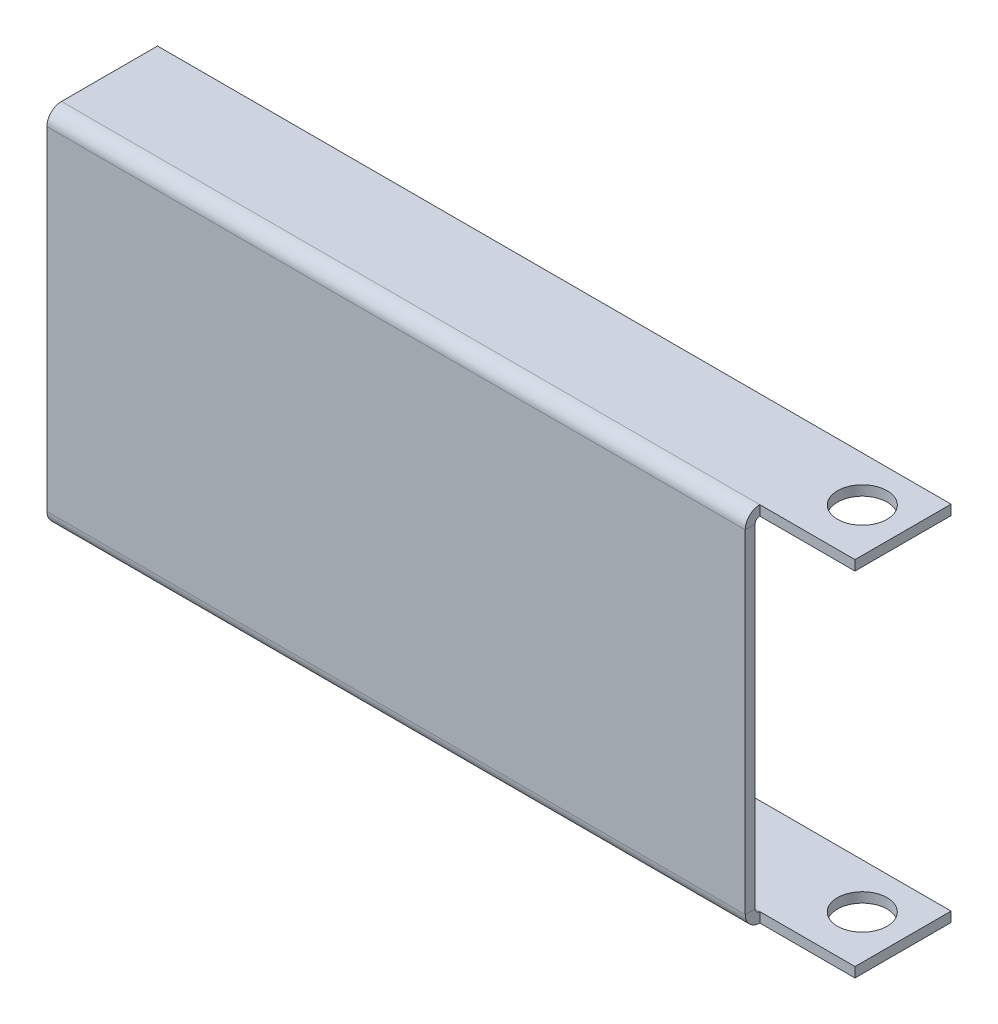
ISO-10303-21;
HEADER;
FILE_DESCRIPTION(('STEP AP214'),'2;1');
FILE_NAME('part.step','',(''),(''),'','','');
FILE_SCHEMA(('AUTOMOTIVE_DESIGN { 1 0 10303 214 1 1 1 1 }'));
ENDSEC;
DATA;
#1=APPLICATION_CONTEXT('core data for automotive mechanical design processes');
#2=APPLICATION_PROTOCOL_DEFINITION('international standard','automotive_design',2000,#1);
#3=PRODUCT_CONTEXT('',#1,'mechanical');
#4=PRODUCT('Part','Part','',(#3));
#5=PRODUCT_RELATED_PRODUCT_CATEGORY('part','',(#4));
#6=PRODUCT_DEFINITION_FORMATION('','',#4);
#7=PRODUCT_DEFINITION_CONTEXT('part definition',#1,'design');
#8=PRODUCT_DEFINITION('design','',#6,#7);
#9=PRODUCT_DEFINITION_SHAPE('','',#8);
#10=(LENGTH_UNIT() NAMED_UNIT(*) SI_UNIT(.MILLI.,.METRE.));
#11=(NAMED_UNIT(*) PLANE_ANGLE_UNIT() SI_UNIT($,.RADIAN.));
#12=(NAMED_UNIT(*) SI_UNIT($,.STERADIAN.) SOLID_ANGLE_UNIT());
#13=UNCERTAINTY_MEASURE_WITH_UNIT(LENGTH_MEASURE(1.E-05),#10,'distance_accuracy_value','');
#14=(GEOMETRIC_REPRESENTATION_CONTEXT(3) GLOBAL_UNCERTAINTY_ASSIGNED_CONTEXT((#13)) GLOBAL_UNIT_ASSIGNED_CONTEXT((#10,
#11,#12)) REPRESENTATION_CONTEXT('',''));
#15=CARTESIAN_POINT('',(0.,0.,0.));
#16=DIRECTION('',(0.,0.,1.));
#17=DIRECTION('',(1.,0.,0.));
#18=AXIS2_PLACEMENT_3D('',#15,#16,#17);
#19=CARTESIAN_POINT('',(0.,0.,-1.5875));
#20=DIRECTION('',(0.,0.,-1.));
#21=DIRECTION('',(-1.,0.,0.));
#22=AXIS2_PLACEMENT_3D('',#19,#20,#21);
#23=PLANE('',#22);
#24=DIRECTION('',(-1.,0.,0.));
#25=VECTOR('',#24,1.);
#26=CARTESIAN_POINT('',(0.,26.67,-1.5875));
#27=LINE('',#26,#25);
#28=CARTESIAN_POINT('',(48.26,26.67,-1.5875));
#29=VERTEX_POINT('',#28);
#30=CARTESIAN_POINT('',(-63.5,26.67,-1.5875));
#31=VERTEX_POINT('',#30);
#32=EDGE_CURVE('E257',#29,#31,#27,.T.);
#33=ORIENTED_EDGE('',*,*,#32,.F.);
#34=DIRECTION('',(0.,1.,0.));
#35=VECTOR('',#34,1.);
#36=CARTESIAN_POINT('',(48.26,0.,-1.5874999999999));
#37=LINE('',#36,#35);
#38=CARTESIAN_POINT('',(48.26,-26.67,-1.5875));
#39=VERTEX_POINT('',#38);
#40=EDGE_CURVE('E324',#29,#39,#37,.F.);
#41=ORIENTED_EDGE('',*,*,#40,.T.);
#42=DIRECTION('',(-1.,0.,0.));
#43=VECTOR('',#42,1.);
#44=CARTESIAN_POINT('',(0.,-26.67,-1.5875));
#45=LINE('',#44,#43);
#46=CARTESIAN_POINT('',(-63.5,-26.67,-1.5875));
#47=VERTEX_POINT('',#46);
#48=EDGE_CURVE('E268',#39,#47,#45,.T.);
#49=ORIENTED_EDGE('',*,*,#48,.T.);
#50=DIRECTION('',(0.,-1.,0.));
#51=VECTOR('',#50,1.);
#52=CARTESIAN_POINT('',(-63.5,44.4500000000001,-1.5875));
#53=LINE('',#52,#51);
#54=EDGE_CURVE('E261',#31,#47,#53,.T.);
#55=ORIENTED_EDGE('',*,*,#54,.F.);
#56=EDGE_LOOP('',(#33,#41,#49,#55));
#57=FACE_BOUND('',#56,.T.);
#58=ADVANCED_FACE('F50',(#57),#23,.T.);
#59=CARTESIAN_POINT('',(0.,0.,0.));
#60=DIRECTION('',(0.,0.,-1.));
#61=DIRECTION('',(-1.,0.,0.));
#62=AXIS2_PLACEMENT_3D('',#59,#60,#61);
#63=PLANE('',#62);
#64=DIRECTION('',(0.,-1.,0.));
#65=VECTOR('',#64,1.);
#66=CARTESIAN_POINT('',(48.26,-27.4066000000001,0.));
#67=LINE('',#66,#65);
#68=CARTESIAN_POINT('',(48.26,26.67,0.));
#69=VERTEX_POINT('',#68);
#70=CARTESIAN_POINT('',(48.26,-26.67,0.));
#71=VERTEX_POINT('',#70);
#72=EDGE_CURVE('E677',#69,#71,#67,.T.);
#73=ORIENTED_EDGE('',*,*,#72,.F.);
#74=DIRECTION('',(-1.,0.,0.));
#75=VECTOR('',#74,1.);
#76=CARTESIAN_POINT('',(0.,26.67,0.));
#77=LINE('',#76,#75);
#78=CARTESIAN_POINT('',(-63.5,26.67,0.));
#79=VERTEX_POINT('',#78);
#80=EDGE_CURVE('E265',#69,#79,#77,.T.);
#81=ORIENTED_EDGE('',*,*,#80,.T.);
#82=DIRECTION('',(0.,-1.,0.));
#83=VECTOR('',#82,1.);
#84=CARTESIAN_POINT('',(-63.5,44.4500000000001,0.));
#85=LINE('',#84,#83);
#86=CARTESIAN_POINT('',(-63.5,-26.67,0.));
#87=VERTEX_POINT('',#86);
#88=EDGE_CURVE('E54',#79,#87,#85,.T.);
#89=ORIENTED_EDGE('',*,*,#88,.T.);
#90=DIRECTION('',(-1.,0.,0.));
#91=VECTOR('',#90,1.);
#92=CARTESIAN_POINT('',(0.,-26.67,0.));
#93=LINE('',#92,#91);
#94=EDGE_CURVE('E60',#71,#87,#93,.T.);
#95=ORIENTED_EDGE('',*,*,#94,.F.);
#96=EDGE_LOOP('',(#73,#81,#89,#95));
#97=FACE_BOUND('',#96,.T.);
#98=ADVANCED_FACE('F282',(#97),#63,.F.);
#99=CARTESIAN_POINT('',(-127.032667996758,26.67,-2.3241));
#100=DIRECTION('',(1.,0.,0.));
#101=DIRECTION('',(0.,1.,0.));
#102=AXIS2_PLACEMENT_3D('',#99,#100,#101);
#103=CYLINDRICAL_SURFACE('',#102,0.7366);
#104=DIRECTION('',(-1.,0.,0.));
#105=VECTOR('',#104,1.);
#106=CARTESIAN_POINT('',(0.,27.4066,-2.3241));
#107=LINE('',#106,#105);
#108=CARTESIAN_POINT('',(48.26,27.4066,-2.3241));
#109=VERTEX_POINT('',#108);
#110=CARTESIAN_POINT('',(-63.5,27.4066,-2.3241));
#111=VERTEX_POINT('',#110);
#112=EDGE_CURVE('E239',#109,#111,#107,.T.);
#113=ORIENTED_EDGE('',*,*,#112,.F.);
#114=CARTESIAN_POINT('',(48.26,26.67,-2.3241));
#115=DIRECTION('',(1.,0.,0.));
#116=DIRECTION('',(0.,0.,-1.));
#117=AXIS2_PLACEMENT_3D('',#114,#115,#116);
#118=CIRCLE('',#117,0.7366);
#119=EDGE_CURVE('E295',#109,#29,#118,.T.);
#120=ORIENTED_EDGE('',*,*,#119,.T.);
#121=ORIENTED_EDGE('',*,*,#32,.T.);
#122=CARTESIAN_POINT('',(-63.5,26.67,-2.3241));
#123=DIRECTION('',(-1.,0.,0.));
#124=DIRECTION('',(0.,0.,-1.));
#125=AXIS2_PLACEMENT_3D('',#122,#123,#124);
#126=CIRCLE('',#125,0.7366);
#127=EDGE_CURVE('E250',#31,#111,#126,.T.);
#128=ORIENTED_EDGE('',*,*,#127,.T.);
#129=EDGE_LOOP('',(#113,#120,#121,#128));
#130=FACE_BOUND('',#129,.T.);
#131=ADVANCED_FACE('F347',(#130),#103,.F.);
#132=CARTESIAN_POINT('',(-127.032667996758,26.67,-2.3241));
#133=DIRECTION('',(1.,0.,0.));
#134=DIRECTION('',(0.,1.,0.));
#135=AXIS2_PLACEMENT_3D('',#132,#133,#134);
#136=CYLINDRICAL_SURFACE('',#135,2.3241);
#137=CARTESIAN_POINT('',(48.26,26.67,-2.3241));
#138=DIRECTION('',(-1.,0.,0.));
#139=DIRECTION('',(0.,-1.,0.));
#140=AXIS2_PLACEMENT_3D('',#137,#138,#139);
#141=CIRCLE('',#140,2.3241);
#142=CARTESIAN_POINT('',(48.26,28.9941,-2.32410000000001));
#143=VERTEX_POINT('',#142);
#144=EDGE_CURVE('E340',#143,#69,#141,.F.);
#145=ORIENTED_EDGE('',*,*,#144,.F.);
#146=DIRECTION('',(-1.,0.,0.));
#147=VECTOR('',#146,1.);
#148=CARTESIAN_POINT('',(0.,28.9941,-2.32410000000001));
#149=LINE('',#148,#147);
#150=CARTESIAN_POINT('',(-63.5,28.9941,-2.3241));
#151=VERTEX_POINT('',#150);
#152=EDGE_CURVE('E199',#143,#151,#149,.T.);
#153=ORIENTED_EDGE('',*,*,#152,.T.);
#154=CARTESIAN_POINT('',(-63.5,26.67,-2.3241));
#155=DIRECTION('',(1.,0.,0.));
#156=DIRECTION('',(0.,1.,0.));
#157=AXIS2_PLACEMENT_3D('',#154,#155,#156);
#158=CIRCLE('',#157,2.3241);
#159=EDGE_CURVE('E208',#79,#151,#158,.F.);
#160=ORIENTED_EDGE('',*,*,#159,.F.);
#161=ORIENTED_EDGE('',*,*,#80,.F.);
#162=EDGE_LOOP('',(#145,#153,#160,#161));
#163=FACE_BOUND('',#162,.T.);
#164=ADVANCED_FACE('F380',(#163),#136,.T.);
#165=CARTESIAN_POINT('',(127.032667996758,-26.6700000000001,-2.3241));
#166=DIRECTION('',(-1.,0.,0.));
#167=DIRECTION('',(0.,-1.,0.));
#168=AXIS2_PLACEMENT_3D('',#165,#166,#167);
#169=CYLINDRICAL_SURFACE('',#168,0.7366);
#170=ORIENTED_EDGE('',*,*,#48,.F.);
#171=CARTESIAN_POINT('',(48.26,-26.67,-2.32409999999999));
#172=DIRECTION('',(1.,0.,0.));
#173=DIRECTION('',(0.,1.,0.));
#174=AXIS2_PLACEMENT_3D('',#171,#172,#173);
#175=CIRCLE('',#174,0.736599999999995);
#176=CARTESIAN_POINT('',(48.26,-27.4066000000001,-2.32409999999997));
#177=VERTEX_POINT('',#176);
#178=EDGE_CURVE('E293',#39,#177,#175,.T.);
#179=ORIENTED_EDGE('',*,*,#178,.T.);
#180=DIRECTION('',(-1.,0.,0.));
#181=VECTOR('',#180,1.);
#182=CARTESIAN_POINT('',(0.,-27.4066,-2.32409999999997));
#183=LINE('',#182,#181);
#184=CARTESIAN_POINT('',(-63.5,-27.4066,-2.3241));
#185=VERTEX_POINT('',#184);
#186=EDGE_CURVE('E175',#177,#185,#183,.T.);
#187=ORIENTED_EDGE('',*,*,#186,.T.);
#188=CARTESIAN_POINT('',(-63.5,-26.67,-2.3241));
#189=DIRECTION('',(-1.,0.,0.));
#190=DIRECTION('',(0.,0.,-1.));
#191=AXIS2_PLACEMENT_3D('',#188,#189,#190);
#192=CIRCLE('',#191,0.7366);
#193=EDGE_CURVE('E195',#185,#47,#192,.T.);
#194=ORIENTED_EDGE('',*,*,#193,.T.);
#195=EDGE_LOOP('',(#170,#179,#187,#194));
#196=FACE_BOUND('',#195,.T.);
#197=ADVANCED_FACE('F290',(#196),#169,.F.);
#198=CARTESIAN_POINT('',(127.032667996758,-26.6700000000001,-2.3241));
#199=DIRECTION('',(-1.,0.,0.));
#200=DIRECTION('',(0.,-1.,0.));
#201=AXIS2_PLACEMENT_3D('',#198,#199,#200);
#202=CYLINDRICAL_SURFACE('',#201,2.3241);
#203=CARTESIAN_POINT('',(48.26,-26.67,-2.32409999999999));
#204=DIRECTION('',(-1.,0.,0.));
#205=DIRECTION('',(0.,-1.,0.));
#206=AXIS2_PLACEMENT_3D('',#203,#204,#205);
#207=CIRCLE('',#206,2.3241);
#208=CARTESIAN_POINT('',(48.26,-28.9941000000001,-2.32409999999997));
#209=VERTEX_POINT('',#208);
#210=EDGE_CURVE('E320',#71,#209,#207,.F.);
#211=ORIENTED_EDGE('',*,*,#210,.F.);
#212=ORIENTED_EDGE('',*,*,#94,.T.);
#213=CARTESIAN_POINT('',(-63.5,-26.67,-2.3241));
#214=DIRECTION('',(-1.,0.,0.));
#215=DIRECTION('',(0.,-1.,0.));
#216=AXIS2_PLACEMENT_3D('',#213,#214,#215);
#217=CIRCLE('',#216,2.3241);
#218=CARTESIAN_POINT('',(-63.5,-28.9941,-2.32409999999997));
#219=VERTEX_POINT('',#218);
#220=EDGE_CURVE('E200',#219,#87,#217,.T.);
#221=ORIENTED_EDGE('',*,*,#220,.F.);
#222=DIRECTION('',(-1.,0.,0.));
#223=VECTOR('',#222,1.);
#224=CARTESIAN_POINT('',(0.,-28.9941,-2.32409999999997));
#225=LINE('',#224,#223);
#226=EDGE_CURVE('E185',#209,#219,#225,.T.);
#227=ORIENTED_EDGE('',*,*,#226,.F.);
#228=EDGE_LOOP('',(#211,#212,#221,#227));
#229=FACE_BOUND('',#228,.T.);
#230=ADVANCED_FACE('F319',(#229),#202,.T.);
#231=CARTESIAN_POINT('',(-63.5,44.4500000000001,-1.5875));
#232=DIRECTION('',(-1.,0.,0.));
#233=DIRECTION('',(0.,-1.,0.));
#234=AXIS2_PLACEMENT_3D('',#231,#232,#233);
#235=PLANE('',#234);
#236=ORIENTED_EDGE('',*,*,#54,.T.);
#237=DIRECTION('',(0.,0.,1.));
#238=VECTOR('',#237,1.);
#239=CARTESIAN_POINT('',(-63.5,-26.67,-1.5875));
#240=LINE('',#239,#238);
#241=EDGE_CURVE('E12',#47,#87,#240,.T.);
#242=ORIENTED_EDGE('',*,*,#241,.T.);
#243=ORIENTED_EDGE('',*,*,#88,.F.);
#244=DIRECTION('',(0.,0.,1.));
#245=VECTOR('',#244,1.);
#246=CARTESIAN_POINT('',(-63.5,26.67,-1.5875));
#247=LINE('',#246,#245);
#248=EDGE_CURVE('E260',#31,#79,#247,.T.);
#249=ORIENTED_EDGE('',*,*,#248,.F.);
#250=EDGE_LOOP('',(#236,#242,#243,#249));
#251=FACE_BOUND('',#250,.T.);
#252=ADVANCED_FACE('F52',(#251),#235,.T.);
#253=CARTESIAN_POINT('',(-63.5,26.67,-2.3241));
#254=DIRECTION('',(1.,0.,0.));
#255=DIRECTION('',(0.,0.,-1.));
#256=AXIS2_PLACEMENT_3D('',#253,#254,#255);
#257=PLANE('',#256);
#258=ORIENTED_EDGE('',*,*,#159,.T.);
#259=DIRECTION('',(0.,1.,0.));
#260=VECTOR('',#259,1.);
#261=CARTESIAN_POINT('',(-63.5,27.4066,-2.3241));
#262=LINE('',#261,#260);
#263=EDGE_CURVE('E227',#111,#151,#262,.T.);
#264=ORIENTED_EDGE('',*,*,#263,.F.);
#265=ORIENTED_EDGE('',*,*,#127,.F.);
#266=ORIENTED_EDGE('',*,*,#248,.T.);
#267=EDGE_LOOP('',(#258,#264,#265,#266));
#268=FACE_BOUND('',#267,.T.);
#269=ADVANCED_FACE('F356',(#268),#257,.F.);
#270=CARTESIAN_POINT('',(63.5,27.4065999999999,-17.7002318412895));
#271=DIRECTION('',(0.,0.,-1.));
#272=DIRECTION('',(-1.,0.,0.));
#273=AXIS2_PLACEMENT_3D('',#270,#271,#272);
#274=PLANE('',#273);
#275=DIRECTION('',(-1.,0.,0.));
#276=VECTOR('',#275,1.);
#277=CARTESIAN_POINT('',(63.5,28.9940999999999,-17.7002318412895));
#278=LINE('',#277,#276);
#279=CARTESIAN_POINT('',(63.5,28.9940999999999,-17.7002318412895));
#280=VERTEX_POINT('',#279);
#281=CARTESIAN_POINT('',(-63.5,28.9941,-17.7002318412895));
#282=VERTEX_POINT('',#281);
#283=EDGE_CURVE('E220',#280,#282,#278,.T.);
#284=ORIENTED_EDGE('',*,*,#283,.F.);
#285=DIRECTION('',(0.,1.,0.));
#286=VECTOR('',#285,1.);
#287=CARTESIAN_POINT('',(63.5,27.4065999999999,-17.7002318412895));
#288=LINE('',#287,#286);
#289=CARTESIAN_POINT('',(63.5,27.4065999999999,-17.7002318412895));
#290=VERTEX_POINT('',#289);
#291=EDGE_CURVE('E204',#290,#280,#288,.T.);
#292=ORIENTED_EDGE('',*,*,#291,.F.);
#293=DIRECTION('',(-1.,0.,0.));
#294=VECTOR('',#293,1.);
#295=CARTESIAN_POINT('',(63.5,27.4065999999999,-17.7002318412895));
#296=LINE('',#295,#294);
#297=CARTESIAN_POINT('',(-63.5,27.4066,-17.7002318412895));
#298=VERTEX_POINT('',#297);
#299=EDGE_CURVE('E243',#290,#298,#296,.T.);
#300=ORIENTED_EDGE('',*,*,#299,.T.);
#301=DIRECTION('',(0.,1.,0.));
#302=VECTOR('',#301,1.);
#303=CARTESIAN_POINT('',(-63.5,27.4066,-17.7002318412895));
#304=LINE('',#303,#302);
#305=EDGE_CURVE('E240',#298,#282,#304,.T.);
#306=ORIENTED_EDGE('',*,*,#305,.T.);
#307=EDGE_LOOP('',(#284,#292,#300,#306));
#308=FACE_BOUND('',#307,.T.);
#309=ADVANCED_FACE('F368',(#308),#274,.T.);
#310=CARTESIAN_POINT('',(0.,27.4066000000001,26.7497681587106));
#311=DIRECTION('',(0.,-1.,0.));
#312=DIRECTION('',(-1.,0.,0.));
#313=AXIS2_PLACEMENT_3D('',#310,#311,#312);
#314=PLANE('',#313);
#315=CARTESIAN_POINT('',(56.515,27.4066,-10.4775));
#316=DIRECTION('',(0.,-1.,0.));
#317=DIRECTION('',(0.,0.,-1.));
#318=AXIS2_PLACEMENT_3D('',#315,#316,#317);
#319=CIRCLE('',#318,3.96875);
#320=CARTESIAN_POINT('',(56.515,27.4066,-14.44625));
#321=VERTEX_POINT('',#320);
#322=EDGE_CURVE('E658',#321,#321,#319,.T.);
#323=ORIENTED_EDGE('',*,*,#322,.F.);
#324=EDGE_LOOP('',(#323));
#325=FACE_BOUND('',#324,.T.);
#326=DIRECTION('',(0.,0.,-1.));
#327=VECTOR('',#326,1.);
#328=CARTESIAN_POINT('',(63.5,27.4065999999999,-17.7002318412895));
#329=LINE('',#328,#327);
#330=CARTESIAN_POINT('',(63.5,27.4066,-2.3241));
#331=VERTEX_POINT('',#330);
#332=EDGE_CURVE('E209',#331,#290,#329,.T.);
#333=ORIENTED_EDGE('',*,*,#332,.F.);
#334=EDGE_CURVE('E235',#331,#109,#107,.T.);
#335=ORIENTED_EDGE('',*,*,#334,.T.);
#336=ORIENTED_EDGE('',*,*,#112,.T.);
#337=DIRECTION('',(0.,0.,1.));
#338=VECTOR('',#337,1.);
#339=CARTESIAN_POINT('',(-63.5,27.4066,-17.7002318412895));
#340=LINE('',#339,#338);
#341=EDGE_CURVE('E231',#298,#111,#340,.T.);
#342=ORIENTED_EDGE('',*,*,#341,.F.);
#343=ORIENTED_EDGE('',*,*,#299,.F.);
#344=EDGE_LOOP('',(#333,#335,#336,#342,#343));
#345=FACE_BOUND('',#344,.T.);
#346=ADVANCED_FACE('F364',(#325,#345),#314,.T.);
#347=CARTESIAN_POINT('',(-63.5,27.4066,-17.7002318412895));
#348=DIRECTION('',(-1.,0.,0.));
#349=DIRECTION('',(0.,0.,1.));
#350=AXIS2_PLACEMENT_3D('',#347,#348,#349);
#351=PLANE('',#350);
#352=ORIENTED_EDGE('',*,*,#341,.T.);
#353=ORIENTED_EDGE('',*,*,#263,.T.);
#354=DIRECTION('',(0.,0.,1.));
#355=VECTOR('',#354,1.);
#356=CARTESIAN_POINT('',(-63.5,28.9941,-17.7002318412895));
#357=LINE('',#356,#355);
#358=EDGE_CURVE('E216',#282,#151,#357,.T.);
#359=ORIENTED_EDGE('',*,*,#358,.F.);
#360=ORIENTED_EDGE('',*,*,#305,.F.);
#361=EDGE_LOOP('',(#352,#353,#359,#360));
#362=FACE_BOUND('',#361,.T.);
#363=ADVANCED_FACE('F359',(#362),#351,.T.);
#364=CARTESIAN_POINT('',(0.,28.9941000000001,26.7497681587106));
#365=DIRECTION('',(0.,-1.,0.));
#366=DIRECTION('',(-1.,0.,0.));
#367=AXIS2_PLACEMENT_3D('',#364,#365,#366);
#368=PLANE('',#367);
#369=CARTESIAN_POINT('',(56.515,28.9941,-10.4775));
#370=DIRECTION('',(0.,1.,0.));
#371=DIRECTION('',(0.,0.,1.));
#372=AXIS2_PLACEMENT_3D('',#369,#370,#371);
#373=CIRCLE('',#372,3.96875);
#374=CARTESIAN_POINT('',(56.515,28.9941,-6.50875000000001));
#375=VERTEX_POINT('',#374);
#376=EDGE_CURVE('E660',#375,#375,#373,.T.);
#377=ORIENTED_EDGE('',*,*,#376,.F.);
#378=EDGE_LOOP('',(#377));
#379=FACE_BOUND('',#378,.T.);
#380=CARTESIAN_POINT('',(63.5,28.9941,-2.32410000000002));
#381=VERTEX_POINT('',#380);
#382=EDGE_CURVE('E247',#381,#143,#149,.T.);
#383=ORIENTED_EDGE('',*,*,#382,.F.);
#384=DIRECTION('',(0.,0.,-1.));
#385=VECTOR('',#384,1.);
#386=CARTESIAN_POINT('',(63.5,28.9940999999999,-17.7002318412895));
#387=LINE('',#386,#385);
#388=EDGE_CURVE('E224',#381,#280,#387,.T.);
#389=ORIENTED_EDGE('',*,*,#388,.T.);
#390=ORIENTED_EDGE('',*,*,#283,.T.);
#391=ORIENTED_EDGE('',*,*,#358,.T.);
#392=ORIENTED_EDGE('',*,*,#152,.F.);
#393=EDGE_LOOP('',(#383,#389,#390,#391,#392));
#394=FACE_BOUND('',#393,.T.);
#395=ADVANCED_FACE('F382',(#379,#394),#368,.F.);
#396=CARTESIAN_POINT('',(63.5,27.4065999999999,-17.7002318412895));
#397=DIRECTION('',(1.,0.,0.));
#398=DIRECTION('',(0.,0.,-1.));
#399=AXIS2_PLACEMENT_3D('',#396,#397,#398);
#400=PLANE('',#399);
#401=ORIENTED_EDGE('',*,*,#388,.F.);
#402=DIRECTION('',(0.,-1.,0.));
#403=VECTOR('',#402,1.);
#404=CARTESIAN_POINT('',(63.5,27.4066,-2.3241));
#405=LINE('',#404,#403);
#406=EDGE_CURVE('E212',#381,#331,#405,.T.);
#407=ORIENTED_EDGE('',*,*,#406,.T.);
#408=ORIENTED_EDGE('',*,*,#332,.T.);
#409=ORIENTED_EDGE('',*,*,#291,.T.);
#410=EDGE_LOOP('',(#401,#407,#408,#409));
#411=FACE_BOUND('',#410,.T.);
#412=ADVANCED_FACE('F371',(#411),#400,.T.);
#413=CARTESIAN_POINT('',(-63.5,-26.67,-2.3241));
#414=DIRECTION('',(1.,0.,0.));
#415=DIRECTION('',(0.,0.,-1.));
#416=AXIS2_PLACEMENT_3D('',#413,#414,#415);
#417=PLANE('',#416);
#418=DIRECTION('',(0.,-1.,0.));
#419=VECTOR('',#418,1.);
#420=CARTESIAN_POINT('',(-63.5,-27.4066,-2.32409999999996));
#421=LINE('',#420,#419);
#422=EDGE_CURVE('E165',#185,#219,#421,.T.);
#423=ORIENTED_EDGE('',*,*,#422,.T.);
#424=ORIENTED_EDGE('',*,*,#220,.T.);
#425=ORIENTED_EDGE('',*,*,#241,.F.);
#426=ORIENTED_EDGE('',*,*,#193,.F.);
#427=EDGE_LOOP('',(#423,#424,#425,#426));
#428=FACE_BOUND('',#427,.T.);
#429=ADVANCED_FACE('F287',(#428),#417,.F.);
#430=CARTESIAN_POINT('',(63.5,-27.4066,-17.7002318412893));
#431=DIRECTION('',(0.,0.,-1.));
#432=DIRECTION('',(1.,0.,0.));
#433=AXIS2_PLACEMENT_3D('',#430,#431,#432);
#434=PLANE('',#433);
#435=DIRECTION('',(1.,0.,0.));
#436=VECTOR('',#435,1.);
#437=CARTESIAN_POINT('',(63.5,-28.9941,-17.7002318412893));
#438=LINE('',#437,#436);
#439=CARTESIAN_POINT('',(-63.5,-28.9941,-17.7002318412894));
#440=VERTEX_POINT('',#439);
#441=CARTESIAN_POINT('',(63.5,-28.9941,-17.7002318412893));
#442=VERTEX_POINT('',#441);
#443=EDGE_CURVE('E304',#440,#442,#438,.T.);
#444=ORIENTED_EDGE('',*,*,#443,.F.);
#445=DIRECTION('',(0.,-1.,0.));
#446=VECTOR('',#445,1.);
#447=CARTESIAN_POINT('',(-63.5,-27.4066,-17.7002318412894));
#448=LINE('',#447,#446);
#449=CARTESIAN_POINT('',(-63.5,-27.4066,-17.7002318412894));
#450=VERTEX_POINT('',#449);
#451=EDGE_CURVE('E203',#450,#440,#448,.T.);
#452=ORIENTED_EDGE('',*,*,#451,.F.);
#453=DIRECTION('',(1.,0.,0.));
#454=VECTOR('',#453,1.);
#455=CARTESIAN_POINT('',(63.5,-27.4066,-17.7002318412893));
#456=LINE('',#455,#454);
#457=CARTESIAN_POINT('',(63.5,-27.4066,-17.7002318412893));
#458=VERTEX_POINT('',#457);
#459=EDGE_CURVE('E164',#450,#458,#456,.T.);
#460=ORIENTED_EDGE('',*,*,#459,.T.);
#461=DIRECTION('',(0.,-1.,0.));
#462=VECTOR('',#461,1.);
#463=CARTESIAN_POINT('',(63.5,-27.4066,-17.7002318412893));
#464=LINE('',#463,#462);
#465=EDGE_CURVE('E179',#458,#442,#464,.T.);
#466=ORIENTED_EDGE('',*,*,#465,.T.);
#467=EDGE_LOOP('',(#444,#452,#460,#466));
#468=FACE_BOUND('',#467,.T.);
#469=ADVANCED_FACE('F465',(#468),#434,.T.);
#470=CARTESIAN_POINT('',(0.,-27.4066000000001,26.7497681587106));
#471=DIRECTION('',(0.,1.,0.));
#472=DIRECTION('',(-1.,0.,0.));
#473=AXIS2_PLACEMENT_3D('',#470,#471,#472);
#474=PLANE('',#473);
#475=CARTESIAN_POINT('',(56.515,-27.4066,-10.4774999999998));
#476=DIRECTION('',(0.,1.,0.));
#477=DIRECTION('',(0.,0.,1.));
#478=AXIS2_PLACEMENT_3D('',#475,#476,#477);
#479=CIRCLE('',#478,3.96875);
#480=CARTESIAN_POINT('',(56.515,-27.4066000000001,-6.50874999999982));
#481=VERTEX_POINT('',#480);
#482=EDGE_CURVE('E666',#481,#481,#479,.T.);
#483=ORIENTED_EDGE('',*,*,#482,.F.);
#484=EDGE_LOOP('',(#483));
#485=FACE_BOUND('',#484,.T.);
#486=CARTESIAN_POINT('',(63.5,-27.4066000000001,-2.32409999999993));
#487=VERTEX_POINT('',#486);
#488=EDGE_CURVE('E156',#487,#177,#183,.T.);
#489=ORIENTED_EDGE('',*,*,#488,.F.);
#490=DIRECTION('',(0.,0.,1.));
#491=VECTOR('',#490,1.);
#492=CARTESIAN_POINT('',(63.4999999999999,-27.4066000000003,71.1997681587107));
#493=LINE('',#492,#491);
#494=EDGE_CURVE('E172',#458,#487,#493,.T.);
#495=ORIENTED_EDGE('',*,*,#494,.F.);
#496=ORIENTED_EDGE('',*,*,#459,.F.);
#497=DIRECTION('',(0.,0.,-1.));
#498=VECTOR('',#497,1.);
#499=CARTESIAN_POINT('',(-63.5000000000001,-27.4066000000003,71.1997681587106));
#500=LINE('',#499,#498);
#501=EDGE_CURVE('E300',#185,#450,#500,.T.);
#502=ORIENTED_EDGE('',*,*,#501,.F.);
#503=ORIENTED_EDGE('',*,*,#186,.F.);
#504=EDGE_LOOP('',(#489,#495,#496,#502,#503));
#505=FACE_BOUND('',#504,.T.);
#506=ADVANCED_FACE('F170',(#485,#505),#474,.T.);
#507=CARTESIAN_POINT('',(63.4999999999999,-27.4066000000003,71.1997681587107));
#508=DIRECTION('',(1.,0.,0.));
#509=DIRECTION('',(0.,0.,1.));
#510=AXIS2_PLACEMENT_3D('',#507,#508,#509);
#511=PLANE('',#510);
#512=DIRECTION('',(0.,1.,0.));
#513=VECTOR('',#512,1.);
#514=CARTESIAN_POINT('',(63.5,-27.4066000000001,-2.32409999999997));
#515=LINE('',#514,#513);
#516=CARTESIAN_POINT('',(63.5,-28.9941000000001,-2.32409999999997));
#517=VERTEX_POINT('',#516);
#518=EDGE_CURVE('E153',#517,#487,#515,.T.);
#519=ORIENTED_EDGE('',*,*,#518,.F.);
#520=DIRECTION('',(0.,0.,1.));
#521=VECTOR('',#520,1.);
#522=CARTESIAN_POINT('',(63.4999999999999,-28.9941000000003,71.1997681587107));
#523=LINE('',#522,#521);
#524=EDGE_CURVE('E181',#442,#517,#523,.T.);
#525=ORIENTED_EDGE('',*,*,#524,.F.);
#526=ORIENTED_EDGE('',*,*,#465,.F.);
#527=ORIENTED_EDGE('',*,*,#494,.T.);
#528=EDGE_LOOP('',(#519,#525,#526,#527));
#529=FACE_BOUND('',#528,.T.);
#530=ADVANCED_FACE('F178',(#529),#511,.T.);
#531=CARTESIAN_POINT('',(0.,-28.9941000000001,26.7497681587106));
#532=DIRECTION('',(0.,1.,0.));
#533=DIRECTION('',(-1.,0.,0.));
#534=AXIS2_PLACEMENT_3D('',#531,#532,#533);
#535=PLANE('',#534);
#536=CARTESIAN_POINT('',(56.515,-28.9941,-10.4774999999998));
#537=DIRECTION('',(0.,1.,0.));
#538=DIRECTION('',(0.,0.,1.));
#539=AXIS2_PLACEMENT_3D('',#536,#537,#538);
#540=CIRCLE('',#539,3.96875);
#541=CARTESIAN_POINT('',(56.515,-28.9941000000001,-6.50874999999981));
#542=VERTEX_POINT('',#541);
#543=EDGE_CURVE('E662',#542,#542,#540,.F.);
#544=ORIENTED_EDGE('',*,*,#543,.F.);
#545=EDGE_LOOP('',(#544));
#546=FACE_BOUND('',#545,.T.);
#547=ORIENTED_EDGE('',*,*,#524,.T.);
#548=EDGE_CURVE('E158',#517,#209,#225,.T.);
#549=ORIENTED_EDGE('',*,*,#548,.T.);
#550=ORIENTED_EDGE('',*,*,#226,.T.);
#551=DIRECTION('',(0.,0.,-1.));
#552=VECTOR('',#551,1.);
#553=CARTESIAN_POINT('',(-63.5000000000001,-28.9941000000003,71.1997681587106));
#554=LINE('',#553,#552);
#555=EDGE_CURVE('E302',#219,#440,#554,.T.);
#556=ORIENTED_EDGE('',*,*,#555,.T.);
#557=ORIENTED_EDGE('',*,*,#443,.T.);
#558=EDGE_LOOP('',(#547,#549,#550,#556,#557));
#559=FACE_BOUND('',#558,.T.);
#560=ADVANCED_FACE('F318',(#546,#559),#535,.F.);
#561=CARTESIAN_POINT('',(-63.5000000000001,-27.4066000000003,71.1997681587106));
#562=DIRECTION('',(-1.,0.,0.));
#563=DIRECTION('',(0.,0.,-1.));
#564=AXIS2_PLACEMENT_3D('',#561,#562,#563);
#565=PLANE('',#564);
#566=ORIENTED_EDGE('',*,*,#422,.F.);
#567=ORIENTED_EDGE('',*,*,#501,.T.);
#568=ORIENTED_EDGE('',*,*,#451,.T.);
#569=ORIENTED_EDGE('',*,*,#555,.F.);
#570=EDGE_LOOP('',(#566,#567,#568,#569));
#571=FACE_BOUND('',#570,.T.);
#572=ADVANCED_FACE('F298',(#571),#565,.T.);
#573=CARTESIAN_POINT('',(48.26,26.67,-2.3241));
#574=DIRECTION('',(-1.,0.,0.));
#575=DIRECTION('',(0.,0.,1.));
#576=AXIS2_PLACEMENT_3D('',#573,#574,#575);
#577=PLANE('',#576);
#578=DIRECTION('',(0.,1.,0.));
#579=VECTOR('',#578,1.);
#580=CARTESIAN_POINT('',(48.26,27.4066000000001,-2.3241));
#581=LINE('',#580,#579);
#582=EDGE_CURVE('E336',#109,#143,#581,.T.);
#583=ORIENTED_EDGE('',*,*,#582,.T.);
#584=ORIENTED_EDGE('',*,*,#144,.T.);
#585=DIRECTION('',(0.,0.,1.));
#586=VECTOR('',#585,1.);
#587=CARTESIAN_POINT('',(48.26,26.67,-1.5874999999999));
#588=LINE('',#587,#586);
#589=EDGE_CURVE('E674',#29,#69,#588,.T.);
#590=ORIENTED_EDGE('',*,*,#589,.F.);
#591=ORIENTED_EDGE('',*,*,#119,.F.);
#592=EDGE_LOOP('',(#583,#584,#590,#591));
#593=FACE_BOUND('',#592,.T.);
#594=ADVANCED_FACE('F376',(#593),#577,.F.);
#595=CARTESIAN_POINT('',(55.8800000000001,27.4066,-2.3241));
#596=DIRECTION('',(0.,0.,-1.));
#597=DIRECTION('',(-1.,0.,0.));
#598=AXIS2_PLACEMENT_3D('',#595,#596,#597);
#599=PLANE('',#598);
#600=ORIENTED_EDGE('',*,*,#582,.F.);
#601=ORIENTED_EDGE('',*,*,#334,.F.);
#602=ORIENTED_EDGE('',*,*,#406,.F.);
#603=ORIENTED_EDGE('',*,*,#382,.T.);
#604=EDGE_LOOP('',(#600,#601,#602,#603));
#605=FACE_BOUND('',#604,.T.);
#606=ADVANCED_FACE('F374',(#605),#599,.F.);
#607=CARTESIAN_POINT('',(55.8800000000001,-27.4066000000002,-2.32409999999997));
#608=DIRECTION('',(0.,0.,1.));
#609=DIRECTION('',(-1.,0.,0.));
#610=AXIS2_PLACEMENT_3D('',#607,#608,#609);
#611=PLANE('',#610);
#612=ORIENTED_EDGE('',*,*,#518,.T.);
#613=ORIENTED_EDGE('',*,*,#488,.T.);
#614=DIRECTION('',(0.,-1.,1.00089258388555E-13));
#615=VECTOR('',#614,1.);
#616=CARTESIAN_POINT('',(48.26,-27.4066000000002,-2.32409999999994));
#617=LINE('',#616,#615);
#618=EDGE_CURVE('E68',#177,#209,#617,.T.);
#619=ORIENTED_EDGE('',*,*,#618,.T.);
#620=ORIENTED_EDGE('',*,*,#548,.F.);
#621=EDGE_LOOP('',(#612,#613,#619,#620));
#622=FACE_BOUND('',#621,.T.);
#623=ADVANCED_FACE('F155',(#622),#611,.T.);
#624=CARTESIAN_POINT('',(48.26,-26.67,-2.32409999999999));
#625=DIRECTION('',(-1.,0.,0.));
#626=DIRECTION('',(0.,-1.,0.));
#627=AXIS2_PLACEMENT_3D('',#624,#625,#626);
#628=PLANE('',#627);
#629=DIRECTION('',(0.,0.,1.));
#630=VECTOR('',#629,1.);
#631=CARTESIAN_POINT('',(48.26,-26.67,-1.5874999999999));
#632=LINE('',#631,#630);
#633=EDGE_CURVE('E330',#39,#71,#632,.T.);
#634=ORIENTED_EDGE('',*,*,#633,.T.);
#635=ORIENTED_EDGE('',*,*,#210,.T.);
#636=ORIENTED_EDGE('',*,*,#618,.F.);
#637=ORIENTED_EDGE('',*,*,#178,.F.);
#638=EDGE_LOOP('',(#634,#635,#636,#637));
#639=FACE_BOUND('',#638,.T.);
#640=ADVANCED_FACE('F603',(#639),#628,.F.);
#641=CARTESIAN_POINT('',(48.26,-27.4066000000001,0.));
#642=DIRECTION('',(1.,0.,0.));
#643=DIRECTION('',(0.,-1.,0.));
#644=AXIS2_PLACEMENT_3D('',#641,#642,#643);
#645=PLANE('',#644);
#646=ORIENTED_EDGE('',*,*,#589,.T.);
#647=ORIENTED_EDGE('',*,*,#72,.T.);
#648=ORIENTED_EDGE('',*,*,#633,.F.);
#649=ORIENTED_EDGE('',*,*,#40,.F.);
#650=EDGE_LOOP('',(#646,#647,#648,#649));
#651=FACE_BOUND('',#650,.T.);
#652=ADVANCED_FACE('F612',(#651),#645,.T.);
#653=CARTESIAN_POINT('',(56.515,-40.2194201513365,-10.4774999999998));
#654=DIRECTION('',(0.,1.,0.));
#655=DIRECTION('',(0.,0.,1.));
#656=AXIS2_PLACEMENT_3D('',#653,#654,#655);
#657=CYLINDRICAL_SURFACE('',#656,3.96875);
#658=ORIENTED_EDGE('',*,*,#482,.T.);
#659=EDGE_LOOP('',(#658));
#660=FACE_BOUND('',#659,.T.);
#661=ORIENTED_EDGE('',*,*,#543,.T.);
#662=EDGE_LOOP('',(#661));
#663=FACE_BOUND('',#662,.T.);
#664=ADVANCED_FACE('F621',(#660,#663),#657,.F.);
#665=ORIENTED_EDGE('',*,*,#322,.T.);
#666=EDGE_LOOP('',(#665));
#667=FACE_BOUND('',#666,.T.);
#668=ORIENTED_EDGE('',*,*,#376,.T.);
#669=EDGE_LOOP('',(#668));
#670=FACE_BOUND('',#669,.T.);
#671=ADVANCED_FACE('F632',(#667,#670),#657,.F.);
#672=CLOSED_SHELL('',(#58,#98,#131,#164,#197,#230,#252,#269,#309,#346,#363,#395,#412,#429,#469,
#506,#530,#560,#572,#594,#606,#623,#640,#652,#664,#671));
#673=MANIFOLD_SOLID_BREP('B2',#672);
#674=ADVANCED_BREP_SHAPE_REPRESENTATION('',(#18,#673),#14);
#675=SHAPE_DEFINITION_REPRESENTATION(#9,#674);
ENDSEC;
END-ISO-10303-21;
